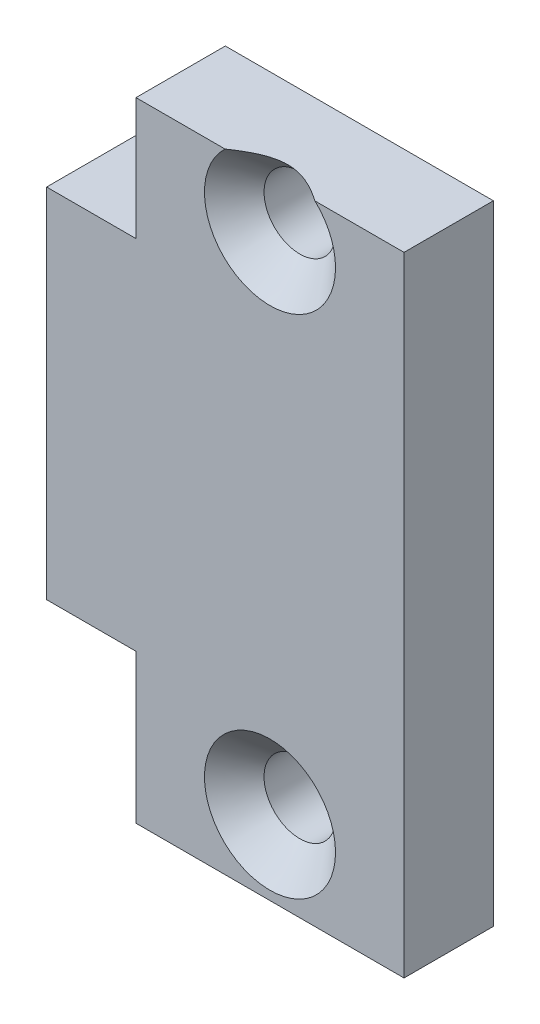
ISO-10303-21;
HEADER;
FILE_DESCRIPTION(('STEP AP214'),'2;1');
FILE_NAME('part.step','',(''),(''),'','','');
FILE_SCHEMA(('AUTOMOTIVE_DESIGN { 1 0 10303 214 1 1 1 1 }'));
ENDSEC;
DATA;
#1=APPLICATION_CONTEXT('core data for automotive mechanical design processes');
#2=APPLICATION_PROTOCOL_DEFINITION('international standard','automotive_design',2000,#1);
#3=PRODUCT_CONTEXT('',#1,'mechanical');
#4=PRODUCT('Part','Part','',(#3));
#5=PRODUCT_RELATED_PRODUCT_CATEGORY('part','',(#4));
#6=PRODUCT_DEFINITION_FORMATION('','',#4);
#7=PRODUCT_DEFINITION_CONTEXT('part definition',#1,'design');
#8=PRODUCT_DEFINITION('design','',#6,#7);
#9=PRODUCT_DEFINITION_SHAPE('','',#8);
#10=(LENGTH_UNIT() NAMED_UNIT(*) SI_UNIT(.MILLI.,.METRE.));
#11=(NAMED_UNIT(*) PLANE_ANGLE_UNIT() SI_UNIT($,.RADIAN.));
#12=(NAMED_UNIT(*) SI_UNIT($,.STERADIAN.) SOLID_ANGLE_UNIT());
#13=UNCERTAINTY_MEASURE_WITH_UNIT(LENGTH_MEASURE(1.E-05),#10,'distance_accuracy_value','');
#14=(GEOMETRIC_REPRESENTATION_CONTEXT(3) GLOBAL_UNCERTAINTY_ASSIGNED_CONTEXT((#13)) GLOBAL_UNIT_ASSIGNED_CONTEXT((#10,
#11,#12)) REPRESENTATION_CONTEXT('',''));
#15=CARTESIAN_POINT('',(0.,0.,0.));
#16=DIRECTION('',(0.,0.,1.));
#17=DIRECTION('',(1.,0.,0.));
#18=AXIS2_PLACEMENT_3D('',#15,#16,#17);
#19=CARTESIAN_POINT('',(-4.5,-11.,3.));
#20=DIRECTION('',(1.,0.,0.));
#21=DIRECTION('',(0.,0.,-1.));
#22=AXIS2_PLACEMENT_3D('',#19,#20,#21);
#23=PLANE('',#22);
#24=DIRECTION('',(0.,0.,1.));
#25=VECTOR('',#24,1.);
#26=CARTESIAN_POINT('',(-4.5,10.1,0.));
#27=LINE('',#26,#25);
#28=CARTESIAN_POINT('',(-4.5,10.1,0.));
#29=VERTEX_POINT('',#28);
#30=CARTESIAN_POINT('',(-4.5,10.1,3.));
#31=VERTEX_POINT('',#30);
#32=EDGE_CURVE('E169',#29,#31,#27,.T.);
#33=ORIENTED_EDGE('',*,*,#32,.F.);
#34=DIRECTION('',(0.,-1.,0.));
#35=VECTOR('',#34,1.);
#36=CARTESIAN_POINT('',(-4.5,-11.,0.));
#37=LINE('',#36,#35);
#38=CARTESIAN_POINT('',(-4.5,6.,0.));
#39=VERTEX_POINT('',#38);
#40=EDGE_CURVE('E224',#29,#39,#37,.T.);
#41=ORIENTED_EDGE('',*,*,#40,.T.);
#42=DIRECTION('',(0.,0.,-1.));
#43=VECTOR('',#42,1.);
#44=CARTESIAN_POINT('',(-4.5,6.,3.));
#45=LINE('',#44,#43);
#46=CARTESIAN_POINT('',(-4.5,6.,3.));
#47=VERTEX_POINT('',#46);
#48=EDGE_CURVE('E191',#47,#39,#45,.T.);
#49=ORIENTED_EDGE('',*,*,#48,.F.);
#50=DIRECTION('',(0.,-1.,0.));
#51=VECTOR('',#50,1.);
#52=CARTESIAN_POINT('',(-4.5,-11.,3.));
#53=LINE('',#52,#51);
#54=EDGE_CURVE('E44',#31,#47,#53,.T.);
#55=ORIENTED_EDGE('',*,*,#54,.F.);
#56=EDGE_LOOP('',(#33,#41,#49,#55));
#57=FACE_BOUND('',#56,.T.);
#58=ADVANCED_FACE('F40',(#57),#23,.F.);
#59=CARTESIAN_POINT('',(4.5,-11.,3.));
#60=DIRECTION('',(-1.,0.,0.));
#61=DIRECTION('',(0.,0.,1.));
#62=AXIS2_PLACEMENT_3D('',#59,#60,#61);
#63=PLANE('',#62);
#64=DIRECTION('',(0.,0.,-1.));
#65=VECTOR('',#64,1.);
#66=CARTESIAN_POINT('',(4.5,10.1,0.));
#67=LINE('',#66,#65);
#68=CARTESIAN_POINT('',(4.5,10.1,3.));
#69=VERTEX_POINT('',#68);
#70=CARTESIAN_POINT('',(4.5,10.1,0.));
#71=VERTEX_POINT('',#70);
#72=EDGE_CURVE('E188',#69,#71,#67,.T.);
#73=ORIENTED_EDGE('',*,*,#72,.F.);
#74=DIRECTION('',(0.,1.,0.));
#75=VECTOR('',#74,1.);
#76=CARTESIAN_POINT('',(4.5,-11.,3.));
#77=LINE('',#76,#75);
#78=CARTESIAN_POINT('',(4.5,-11.,3.));
#79=VERTEX_POINT('',#78);
#80=EDGE_CURVE('E201',#79,#69,#77,.T.);
#81=ORIENTED_EDGE('',*,*,#80,.F.);
#82=DIRECTION('',(0.,0.,-1.));
#83=VECTOR('',#82,1.);
#84=CARTESIAN_POINT('',(4.5,-11.,3.));
#85=LINE('',#84,#83);
#86=CARTESIAN_POINT('',(4.5,-11.,0.));
#87=VERTEX_POINT('',#86);
#88=EDGE_CURVE('E198',#79,#87,#85,.T.);
#89=ORIENTED_EDGE('',*,*,#88,.T.);
#90=DIRECTION('',(0.,1.,0.));
#91=VECTOR('',#90,1.);
#92=CARTESIAN_POINT('',(4.5,-11.,0.));
#93=LINE('',#92,#91);
#94=EDGE_CURVE('E220',#87,#71,#93,.T.);
#95=ORIENTED_EDGE('',*,*,#94,.T.);
#96=EDGE_LOOP('',(#73,#81,#89,#95));
#97=FACE_BOUND('',#96,.T.);
#98=ADVANCED_FACE('F42',(#97),#63,.F.);
#99=CARTESIAN_POINT('',(0.,0.,3.));
#100=DIRECTION('',(0.,0.,-1.));
#101=DIRECTION('',(-1.,0.,0.));
#102=AXIS2_PLACEMENT_3D('',#99,#100,#101);
#103=PLANE('',#102);
#104=CARTESIAN_POINT('',(0.,-8.5,3.));
#105=DIRECTION('',(0.,0.,1.));
#106=DIRECTION('',(1.,0.,0.));
#107=AXIS2_PLACEMENT_3D('',#104,#105,#106);
#108=CIRCLE('',#107,2.2);
#109=CARTESIAN_POINT('',(2.2,-8.5,3.));
#110=VERTEX_POINT('',#109);
#111=EDGE_CURVE('E275',#110,#110,#108,.T.);
#112=ORIENTED_EDGE('',*,*,#111,.F.);
#113=EDGE_LOOP('',(#112));
#114=FACE_BOUND('',#113,.T.);
#115=DIRECTION('',(1.,0.,0.));
#116=VECTOR('',#115,1.);
#117=CARTESIAN_POINT('',(-4.5,10.1,3.));
#118=LINE('',#117,#116);
#119=CARTESIAN_POINT('',(-1.50996688705415,10.1,3.));
#120=VERTEX_POINT('',#119);
#121=EDGE_CURVE('E60',#31,#120,#118,.T.);
#122=ORIENTED_EDGE('',*,*,#121,.F.);
#123=ORIENTED_EDGE('',*,*,#54,.T.);
#124=DIRECTION('',(1.,0.,0.));
#125=VECTOR('',#124,1.);
#126=CARTESIAN_POINT('',(-7.5,6.,3.));
#127=LINE('',#126,#125);
#128=CARTESIAN_POINT('',(-7.5,6.,3.));
#129=VERTEX_POINT('',#128);
#130=EDGE_CURVE('E288',#129,#47,#127,.T.);
#131=ORIENTED_EDGE('',*,*,#130,.F.);
#132=DIRECTION('',(0.,1.,0.));
#133=VECTOR('',#132,1.);
#134=CARTESIAN_POINT('',(-7.5,-6.,3.));
#135=LINE('',#134,#133);
#136=CARTESIAN_POINT('',(-7.5,-6.,3.));
#137=VERTEX_POINT('',#136);
#138=EDGE_CURVE('E310',#137,#129,#135,.T.);
#139=ORIENTED_EDGE('',*,*,#138,.F.);
#140=DIRECTION('',(1.,0.,0.));
#141=VECTOR('',#140,1.);
#142=CARTESIAN_POINT('',(-7.5,-6.,3.));
#143=LINE('',#142,#141);
#144=CARTESIAN_POINT('',(-4.5,-6.,3.));
#145=VERTEX_POINT('',#144);
#146=EDGE_CURVE('E305',#137,#145,#143,.T.);
#147=ORIENTED_EDGE('',*,*,#146,.T.);
#148=CARTESIAN_POINT('',(-4.5,-11.,3.));
#149=VERTEX_POINT('',#148);
#150=EDGE_CURVE('E71',#145,#149,#53,.T.);
#151=ORIENTED_EDGE('',*,*,#150,.T.);
#152=DIRECTION('',(1.,0.,0.));
#153=VECTOR('',#152,1.);
#154=CARTESIAN_POINT('',(-4.5,-11.,3.));
#155=LINE('',#154,#153);
#156=EDGE_CURVE('E194',#149,#79,#155,.T.);
#157=ORIENTED_EDGE('',*,*,#156,.T.);
#158=ORIENTED_EDGE('',*,*,#80,.T.);
#159=CARTESIAN_POINT('',(1.50996688705415,10.1,3.));
#160=VERTEX_POINT('',#159);
#161=EDGE_CURVE('E177',#160,#69,#118,.T.);
#162=ORIENTED_EDGE('',*,*,#161,.F.);
#163=CARTESIAN_POINT('',(0.,8.5,3.));
#164=DIRECTION('',(0.,0.,1.));
#165=DIRECTION('',(1.,0.,0.));
#166=AXIS2_PLACEMENT_3D('',#163,#164,#165);
#167=CIRCLE('',#166,2.2);
#168=EDGE_CURVE('E186',#120,#160,#167,.T.);
#169=ORIENTED_EDGE('',*,*,#168,.F.);
#170=EDGE_LOOP('',(#122,#123,#131,#139,#147,#151,#157,#158,#162,#169));
#171=FACE_BOUND('',#170,.T.);
#172=ADVANCED_FACE('F181',(#114,#171),#103,.F.);
#173=CARTESIAN_POINT('',(0.,0.,0.));
#174=DIRECTION('',(0.,0.,-1.));
#175=DIRECTION('',(-1.,0.,0.));
#176=AXIS2_PLACEMENT_3D('',#173,#174,#175);
#177=PLANE('',#176);
#178=CARTESIAN_POINT('',(0.,-8.5,0.));
#179=DIRECTION('',(0.,0.,-1.));
#180=DIRECTION('',(-1.,0.,0.));
#181=AXIS2_PLACEMENT_3D('',#178,#179,#180);
#182=CIRCLE('',#181,1.19999999999999);
#183=CARTESIAN_POINT('',(-1.19999999999999,-8.5,0.));
#184=VERTEX_POINT('',#183);
#185=EDGE_CURVE('E223',#184,#184,#182,.T.);
#186=ORIENTED_EDGE('',*,*,#185,.F.);
#187=EDGE_LOOP('',(#186));
#188=FACE_BOUND('',#187,.T.);
#189=CARTESIAN_POINT('',(0.,8.5,0.));
#190=DIRECTION('',(0.,0.,-1.));
#191=DIRECTION('',(-1.,0.,0.));
#192=AXIS2_PLACEMENT_3D('',#189,#190,#191);
#193=CIRCLE('',#192,1.19999999999999);
#194=CARTESIAN_POINT('',(-1.19999999999999,8.5,0.));
#195=VERTEX_POINT('',#194);
#196=EDGE_CURVE('E236',#195,#195,#193,.T.);
#197=ORIENTED_EDGE('',*,*,#196,.F.);
#198=EDGE_LOOP('',(#197));
#199=FACE_BOUND('',#198,.T.);
#200=ORIENTED_EDGE('',*,*,#40,.F.);
#201=DIRECTION('',(-1.,0.,0.));
#202=VECTOR('',#201,1.);
#203=CARTESIAN_POINT('',(-4.5,10.1,0.));
#204=LINE('',#203,#202);
#205=EDGE_CURVE('E172',#71,#29,#204,.T.);
#206=ORIENTED_EDGE('',*,*,#205,.F.);
#207=ORIENTED_EDGE('',*,*,#94,.F.);
#208=DIRECTION('',(1.,0.,0.));
#209=VECTOR('',#208,1.);
#210=CARTESIAN_POINT('',(-4.5,-11.,0.));
#211=LINE('',#210,#209);
#212=CARTESIAN_POINT('',(-4.5,-11.,0.));
#213=VERTEX_POINT('',#212);
#214=EDGE_CURVE('E207',#213,#87,#211,.T.);
#215=ORIENTED_EDGE('',*,*,#214,.F.);
#216=CARTESIAN_POINT('',(-4.5,-6.,0.));
#217=VERTEX_POINT('',#216);
#218=EDGE_CURVE('E211',#217,#213,#37,.T.);
#219=ORIENTED_EDGE('',*,*,#218,.F.);
#220=CARTESIAN_POINT('',(-4.5,-3.79868398264452,0.));
#221=VERTEX_POINT('',#220);
#222=EDGE_CURVE('E235',#221,#217,#37,.T.);
#223=ORIENTED_EDGE('',*,*,#222,.F.);
#224=DIRECTION('',(1.,0.,0.));
#225=VECTOR('',#224,1.);
#226=CARTESIAN_POINT('',(-7.5,-3.79868398264452,0.));
#227=LINE('',#226,#225);
#228=CARTESIAN_POINT('',(-7.5,-3.79868398264452,0.));
#229=VERTEX_POINT('',#228);
#230=EDGE_CURVE('E301',#229,#221,#227,.T.);
#231=ORIENTED_EDGE('',*,*,#230,.F.);
#232=DIRECTION('',(0.,-1.,0.));
#233=VECTOR('',#232,1.);
#234=CARTESIAN_POINT('',(-7.5,3.79868398264452,0.));
#235=LINE('',#234,#233);
#236=CARTESIAN_POINT('',(-7.5,3.79868398264452,0.));
#237=VERTEX_POINT('',#236);
#238=EDGE_CURVE('E433',#237,#229,#235,.T.);
#239=ORIENTED_EDGE('',*,*,#238,.F.);
#240=DIRECTION('',(1.,0.,0.));
#241=VECTOR('',#240,1.);
#242=CARTESIAN_POINT('',(-7.5,3.79868398264452,0.));
#243=LINE('',#242,#241);
#244=CARTESIAN_POINT('',(-4.5,3.79868398264452,0.));
#245=VERTEX_POINT('',#244);
#246=EDGE_CURVE('E296',#237,#245,#243,.T.);
#247=ORIENTED_EDGE('',*,*,#246,.T.);
#248=EDGE_CURVE('E228',#39,#245,#37,.T.);
#249=ORIENTED_EDGE('',*,*,#248,.F.);
#250=EDGE_LOOP('',(#200,#206,#207,#215,#219,#223,#231,#239,#247,#249));
#251=FACE_BOUND('',#250,.T.);
#252=ADVANCED_FACE('F263',(#188,#199,#251),#177,.T.);
#253=CARTESIAN_POINT('',(0.,8.5,3.));
#254=DIRECTION('',(0.,0.,1.));
#255=DIRECTION('',(1.,0.,0.));
#256=AXIS2_PLACEMENT_3D('',#253,#254,#255);
#257=CONICAL_SURFACE('',#256,2.2,0.785398163397448);
#258=CARTESIAN_POINT('',(0.,8.5,2.));
#259=DIRECTION('',(0.,0.,1.));
#260=DIRECTION('',(1.,0.,0.));
#261=AXIS2_PLACEMENT_3D('',#258,#259,#260);
#262=CIRCLE('',#261,1.2);
#263=CARTESIAN_POINT('',(1.2,8.5,2.));
#264=VERTEX_POINT('',#263);
#265=EDGE_CURVE('E282',#264,#264,#262,.T.);
#266=ORIENTED_EDGE('',*,*,#265,.F.);
#267=EDGE_LOOP('',(#266));
#268=FACE_BOUND('',#267,.T.);
#269=CARTESIAN_POINT('',(-3.20182887445577,10.1,4.37934465248859));
#270=CARTESIAN_POINT('',(-3.12853614947158,10.1,4.31379182832102));
#271=CARTESIAN_POINT('',(-3.05502807315389,10.1,4.24847761157401));
#272=CARTESIAN_POINT('',(-2.90746755937087,10.1,4.11845331479738));
#273=CARTESIAN_POINT('',(-2.83341507132932,10.1,4.05374329219854));
#274=CARTESIAN_POINT('',(-2.68438079750646,10.1,3.92482012409343));
#275=CARTESIAN_POINT('',(-2.60939653791931,10.1,3.86060983322152));
#276=CARTESIAN_POINT('',(-2.45863490149013,10.1,3.73313212573307));
#277=CARTESIAN_POINT('',(-2.38285755845312,10.1,3.6698646692048));
#278=CARTESIAN_POINT('',(-2.22593570276166,10.1,3.54092571800481));
#279=CARTESIAN_POINT('',(-2.14473294084436,10.1,3.4753249130966));
#280=CARTESIAN_POINT('',(-1.98093123018198,10.1,3.34589188486072));
#281=CARTESIAN_POINT('',(-1.89833235989646,10.1,3.28205956267508));
#282=CARTESIAN_POINT('',(-1.73145912652458,10.1,3.1568851815129));
#283=CARTESIAN_POINT('',(-1.64718753930119,10.1,3.09553943925733));
#284=CARTESIAN_POINT('',(-1.47632445098495,10.1,2.97618586016186));
#285=CARTESIAN_POINT('',(-1.38973368044018,10.1,2.91817698990935));
#286=CARTESIAN_POINT('',(-1.23774091002173,10.1,2.82226523665156));
#287=CARTESIAN_POINT('',(-1.17306282578654,10.1,2.78322119953104));
#288=CARTESIAN_POINT('',(-1.04174600910055,10.1,2.70848513118061));
#289=CARTESIAN_POINT('',(-0.975106591920854,10.1,2.6727942892733));
#290=CARTESIAN_POINT('',(-0.840142732771387,10.1,2.60621778907623));
#291=CARTESIAN_POINT('',(-0.771837313369966,10.1,2.5752940367165));
#292=CARTESIAN_POINT('',(-0.632818277225735,10.1,2.51942445111484));
#293=CARTESIAN_POINT('',(-0.562106525663244,10.1,2.49447410314791));
#294=CARTESIAN_POINT('',(-0.443500381883852,10.1,2.4597274810717));
#295=CARTESIAN_POINT('',(-0.396265683912665,10.1,2.44768228358472));
#296=CARTESIAN_POINT('',(-0.300991488762931,10.1,2.42740054934075));
#297=CARTESIAN_POINT('',(-0.252952325760666,10.1,2.41916246986682));
#298=CARTESIAN_POINT('',(-0.156477459482139,10.1,2.40692381530357));
#299=CARTESIAN_POINT('',(-0.108043398504506,10.1,2.40291047779933));
#300=CARTESIAN_POINT('',(-0.0110081449667254,10.1,2.39930332986374));
#301=CARTESIAN_POINT('',(0.0375930470793092,10.1,2.39970950584962));
#302=CARTESIAN_POINT('',(0.134510347360759,10.1,2.40491521134275));
#303=CARTESIAN_POINT('',(0.182826678178774,10.1,2.40971066618715));
#304=CARTESIAN_POINT('',(0.278872347532461,10.1,2.42342496186675));
#305=CARTESIAN_POINT('',(0.326601549833291,10.1,2.43234474183303));
#306=CARTESIAN_POINT('',(0.421395958927725,10.1,2.4539145631776));
#307=CARTESIAN_POINT('',(0.468457819361122,10.1,2.46657912560897));
#308=CARTESIAN_POINT('',(0.56158563620134,10.1,2.49511531614254));
#309=CARTESIAN_POINT('',(0.607651581962384,10.1,2.51098697850812));
#310=CARTESIAN_POINT('',(0.768171456261142,10.1,2.5716433107159));
#311=CARTESIAN_POINT('',(0.879896111575032,10.1,2.62363882799123));
#312=CARTESIAN_POINT('',(1.09782706764466,10.1,2.73819435026224));
#313=CARTESIAN_POINT('',(1.20401988045189,10.1,2.80077872863963));
#314=CARTESIAN_POINT('',(1.36087087405826,10.1,2.90007856637253));
#315=CARTESIAN_POINT('',(1.41310657544917,10.1,2.93434289538547));
#316=CARTESIAN_POINT('',(1.51664506340802,10.1,3.00425649434365));
#317=CARTESIAN_POINT('',(1.56794782246458,10.1,3.03990580503344));
#318=CARTESIAN_POINT('',(1.66969851033807,10.1,3.1122754051233));
#319=CARTESIAN_POINT('',(1.72014737054832,10.1,3.14899439036753));
#320=CARTESIAN_POINT('',(1.8203638316988,10.1,3.22334461387101));
#321=CARTESIAN_POINT('',(1.87013145799695,10.1,3.26097581802899));
#322=CARTESIAN_POINT('',(2.03705948280169,10.1,3.3891932892268));
#323=CARTESIAN_POINT('',(2.15288693016817,10.1,3.48151457607307));
#324=CARTESIAN_POINT('',(2.38226799461682,10.1,3.66894758420709));
#325=CARTESIAN_POINT('',(2.49582126942867,10.1,3.76405972029487));
#326=CARTESIAN_POINT('',(2.72131042468619,10.1,3.95627222441099));
#327=CARTESIAN_POINT('',(2.83324561129814,10.1,4.05337340458566));
#328=CARTESIAN_POINT('',(3.05587263708969,10.1,4.24899287485125));
#329=CARTESIAN_POINT('',(3.16656443983364,10.1,4.3475112062779));
#330=CARTESIAN_POINT('',(3.49768016283532,10.1,4.64503269865411));
#331=CARTESIAN_POINT('',(3.71668916589072,10.1,4.84560864480682));
#332=CARTESIAN_POINT('',(4.15233950106787,10.1,5.24919047556957));
#333=CARTESIAN_POINT('',(4.36898142222063,10.1,5.45219572804613));
#334=CARTESIAN_POINT('',(4.77514922442491,10.1,5.83568591316177));
#335=CARTESIAN_POINT('',(4.96484665900095,10.1,6.01598932091867));
#336=CARTESIAN_POINT('',(5.34339055790859,10.1,6.37751587984974));
#337=CARTESIAN_POINT('',(5.53223695418509,10.1,6.55873910219867));
#338=CARTESIAN_POINT('',(5.90862260074649,10.1,6.92121322883283));
#339=CARTESIAN_POINT('',(6.0961641122431,10.1,7.10246178683362));
#340=CARTESIAN_POINT('',(6.47073281461346,10.1,7.4654562555927));
#341=CARTESIAN_POINT('',(6.6577600499652,10.1,7.64720212044278));
#342=CARTESIAN_POINT('',(6.84460899400552,10.1,7.82913026489204));
#343=B_SPLINE_CURVE_WITH_KNOTS('',3,(#269,#270,#271,#272,#273,#274,#275,#276,#277,#278,#279,
#280,#281,#282,#283,#284,#285,#286,#287,#288,#289,#290,#291,#292,#293,#294,#295,#296,#297,#298,
#299,#300,#301,#302,#303,#304,#305,#306,#307,#308,#309,#310,#311,#312,#313,#314,#315,#316,#317,
#318,#319,#320,#321,#322,#323,#324,#325,#326,#327,#328,#329,#330,#331,#332,#333,#334,#335,#336,
#337,#338,#339,#340,#341,#342),.UNSPECIFIED.,.F.,.F.,(4,2,2,2,2,2,2,2,2,2,2,2,2,2,2,2,2,2,2,2,2,
2,2,2,2,2,2,2,2,2,2,2,2,2,2,2,4),(0.,0.294994797046253,0.590017354619906,0.886170553001911,
1.18231117891316,1.49546431418164,1.808599908762,2.12125332115891,2.43380937919982,
2.66038414787755,2.88703897785185,3.11177648776328,3.33634360003526,3.48245064896947,
3.6284984405104,3.77410376270957,3.91970863741118,4.06517848088743,4.21068146495663,
4.35675623166072,4.50283255905207,4.87144987525727,5.24092751270396,5.42832035808236,
5.61571872052186,5.80289745184233,5.99006919666065,6.43434883056739,6.87869483499185,
7.32322603686173,7.76777023129846,8.65866387378407,9.54933052953064,10.3344694669517,
11.1196701135134,11.9021047969373,12.684469536217),.UNSPECIFIED.);
#344=EDGE_CURVE('E11',#120,#160,#343,.T.);
#345=ORIENTED_EDGE('',*,*,#344,.F.);
#346=ORIENTED_EDGE('',*,*,#168,.T.);
#347=EDGE_LOOP('',(#345,#346));
#348=FACE_BOUND('',#347,.T.);
#349=ADVANCED_FACE('F357',(#268,#348),#257,.F.);
#350=DIRECTION('',(0.,0.,1.));
#351=VECTOR('',#350,1.);
#352=CARTESIAN_POINT('',(-4.5,-6.,-2.));
#353=LINE('',#352,#351);
#354=EDGE_CURVE('E51',#217,#145,#353,.T.);
#355=ORIENTED_EDGE('',*,*,#354,.F.);
#356=ORIENTED_EDGE('',*,*,#218,.T.);
#357=DIRECTION('',(0.,0.,-1.));
#358=VECTOR('',#357,1.);
#359=CARTESIAN_POINT('',(-4.5,-11.,3.));
#360=LINE('',#359,#358);
#361=EDGE_CURVE('E252',#149,#213,#360,.T.);
#362=ORIENTED_EDGE('',*,*,#361,.F.);
#363=ORIENTED_EDGE('',*,*,#150,.F.);
#364=EDGE_LOOP('',(#355,#356,#362,#363));
#365=FACE_BOUND('',#364,.T.);
#366=ADVANCED_FACE('F251',(#365),#23,.F.);
#367=CARTESIAN_POINT('',(-4.5,-11.,3.));
#368=DIRECTION('',(0.,1.,0.));
#369=DIRECTION('',(0.,0.,1.));
#370=AXIS2_PLACEMENT_3D('',#367,#368,#369);
#371=PLANE('',#370);
#372=ORIENTED_EDGE('',*,*,#214,.T.);
#373=ORIENTED_EDGE('',*,*,#88,.F.);
#374=ORIENTED_EDGE('',*,*,#156,.F.);
#375=ORIENTED_EDGE('',*,*,#361,.T.);
#376=EDGE_LOOP('',(#372,#373,#374,#375));
#377=FACE_BOUND('',#376,.T.);
#378=ADVANCED_FACE('F257',(#377),#371,.F.);
#379=CARTESIAN_POINT('',(0.,-8.5,3.));
#380=DIRECTION('',(0.,0.,1.));
#381=DIRECTION('',(1.,0.,0.));
#382=AXIS2_PLACEMENT_3D('',#379,#380,#381);
#383=CYLINDRICAL_SURFACE('',#382,1.19999999999999);
#384=ORIENTED_EDGE('',*,*,#185,.T.);
#385=EDGE_LOOP('',(#384));
#386=FACE_BOUND('',#385,.T.);
#387=CARTESIAN_POINT('',(0.,-8.5,2.));
#388=DIRECTION('',(0.,0.,1.));
#389=DIRECTION('',(1.,0.,0.));
#390=AXIS2_PLACEMENT_3D('',#387,#388,#389);
#391=CIRCLE('',#390,1.2);
#392=CARTESIAN_POINT('',(1.2,-8.5,2.));
#393=VERTEX_POINT('',#392);
#394=EDGE_CURVE('E270',#393,#393,#391,.T.);
#395=ORIENTED_EDGE('',*,*,#394,.T.);
#396=EDGE_LOOP('',(#395));
#397=FACE_BOUND('',#396,.T.);
#398=ADVANCED_FACE('F409',(#386,#397),#383,.F.);
#399=CARTESIAN_POINT('',(0.,-8.5,3.));
#400=DIRECTION('',(0.,0.,1.));
#401=DIRECTION('',(1.,0.,0.));
#402=AXIS2_PLACEMENT_3D('',#399,#400,#401);
#403=CONICAL_SURFACE('',#402,2.2,0.785398163397448);
#404=ORIENTED_EDGE('',*,*,#394,.F.);
#405=EDGE_LOOP('',(#404));
#406=FACE_BOUND('',#405,.T.);
#407=ORIENTED_EDGE('',*,*,#111,.T.);
#408=EDGE_LOOP('',(#407));
#409=FACE_BOUND('',#408,.T.);
#410=ADVANCED_FACE('F467',(#406,#409),#403,.F.);
#411=CARTESIAN_POINT('',(0.,8.5,3.));
#412=DIRECTION('',(0.,0.,1.));
#413=DIRECTION('',(1.,0.,0.));
#414=AXIS2_PLACEMENT_3D('',#411,#412,#413);
#415=CYLINDRICAL_SURFACE('',#414,1.19999999999999);
#416=ORIENTED_EDGE('',*,*,#196,.T.);
#417=EDGE_LOOP('',(#416));
#418=FACE_BOUND('',#417,.T.);
#419=ORIENTED_EDGE('',*,*,#265,.T.);
#420=EDGE_LOOP('',(#419));
#421=FACE_BOUND('',#420,.T.);
#422=ADVANCED_FACE('F397',(#418,#421),#415,.F.);
#423=CARTESIAN_POINT('',(-4.5,0.,-4.9));
#424=DIRECTION('',(1.,0.,0.));
#425=DIRECTION('',(0.,0.,-1.));
#426=AXIS2_PLACEMENT_3D('',#423,#424,#425);
#427=PLANE('',#426);
#428=CARTESIAN_POINT('',(-4.5,6.,-2.));
#429=VERTEX_POINT('',#428);
#430=EDGE_CURVE('E319',#39,#429,#45,.T.);
#431=ORIENTED_EDGE('',*,*,#430,.F.);
#432=ORIENTED_EDGE('',*,*,#248,.T.);
#433=CARTESIAN_POINT('',(-4.5,0.,-4.9));
#434=DIRECTION('',(1.,0.,0.));
#435=DIRECTION('',(0.,0.,-1.));
#436=AXIS2_PLACEMENT_3D('',#433,#434,#435);
#437=CIRCLE('',#436,6.2);
#438=CARTESIAN_POINT('',(-4.5,5.4799635035281,-2.));
#439=VERTEX_POINT('',#438);
#440=EDGE_CURVE('E318',#439,#245,#437,.T.);
#441=ORIENTED_EDGE('',*,*,#440,.F.);
#442=DIRECTION('',(0.,-1.,0.));
#443=VECTOR('',#442,1.);
#444=CARTESIAN_POINT('',(-4.5,6.,-2.));
#445=LINE('',#444,#443);
#446=EDGE_CURVE('E315',#429,#439,#445,.T.);
#447=ORIENTED_EDGE('',*,*,#446,.F.);
#448=EDGE_LOOP('',(#431,#432,#441,#447));
#449=FACE_BOUND('',#448,.T.);
#450=ADVANCED_FACE('F372',(#449),#427,.T.);
#451=CARTESIAN_POINT('',(-7.5,6.,3.));
#452=DIRECTION('',(0.,-1.,0.));
#453=DIRECTION('',(0.,0.,-1.));
#454=AXIS2_PLACEMENT_3D('',#451,#452,#453);
#455=PLANE('',#454);
#456=ORIENTED_EDGE('',*,*,#48,.T.);
#457=ORIENTED_EDGE('',*,*,#430,.T.);
#458=DIRECTION('',(1.,0.,0.));
#459=VECTOR('',#458,1.);
#460=CARTESIAN_POINT('',(-7.5,6.,-2.));
#461=LINE('',#460,#459);
#462=CARTESIAN_POINT('',(-7.5,6.,-2.));
#463=VERTEX_POINT('',#462);
#464=EDGE_CURVE('E289',#463,#429,#461,.T.);
#465=ORIENTED_EDGE('',*,*,#464,.F.);
#466=DIRECTION('',(0.,0.,-1.));
#467=VECTOR('',#466,1.);
#468=CARTESIAN_POINT('',(-7.5,6.,3.));
#469=LINE('',#468,#467);
#470=EDGE_CURVE('E426',#129,#463,#469,.T.);
#471=ORIENTED_EDGE('',*,*,#470,.F.);
#472=ORIENTED_EDGE('',*,*,#130,.T.);
#473=EDGE_LOOP('',(#456,#457,#465,#471,#472));
#474=FACE_BOUND('',#473,.T.);
#475=ADVANCED_FACE('F390',(#474),#455,.F.);
#476=CARTESIAN_POINT('',(-7.5,6.,-2.));
#477=DIRECTION('',(0.,0.,1.));
#478=DIRECTION('',(0.,-1.,0.));
#479=AXIS2_PLACEMENT_3D('',#476,#477,#478);
#480=PLANE('',#479);
#481=ORIENTED_EDGE('',*,*,#446,.T.);
#482=DIRECTION('',(1.,0.,0.));
#483=VECTOR('',#482,1.);
#484=CARTESIAN_POINT('',(-7.5,5.4799635035281,-2.));
#485=LINE('',#484,#483);
#486=CARTESIAN_POINT('',(-7.5,5.4799635035281,-2.));
#487=VERTEX_POINT('',#486);
#488=EDGE_CURVE('E293',#487,#439,#485,.T.);
#489=ORIENTED_EDGE('',*,*,#488,.F.);
#490=DIRECTION('',(0.,-1.,0.));
#491=VECTOR('',#490,1.);
#492=CARTESIAN_POINT('',(-7.5,6.,-2.));
#493=LINE('',#492,#491);
#494=EDGE_CURVE('E428',#463,#487,#493,.T.);
#495=ORIENTED_EDGE('',*,*,#494,.F.);
#496=ORIENTED_EDGE('',*,*,#464,.T.);
#497=EDGE_LOOP('',(#481,#489,#495,#496));
#498=FACE_BOUND('',#497,.T.);
#499=ADVANCED_FACE('F387',(#498),#480,.F.);
#500=CARTESIAN_POINT('',(-7.5,0.,-4.9));
#501=DIRECTION('',(1.,0.,0.));
#502=DIRECTION('',(0.,0.,-1.));
#503=AXIS2_PLACEMENT_3D('',#500,#501,#502);
#504=CYLINDRICAL_SURFACE('',#503,6.2);
#505=ORIENTED_EDGE('',*,*,#440,.T.);
#506=ORIENTED_EDGE('',*,*,#246,.F.);
#507=CARTESIAN_POINT('',(-7.5,0.,-4.9));
#508=DIRECTION('',(1.,0.,0.));
#509=DIRECTION('',(0.,0.,-1.));
#510=AXIS2_PLACEMENT_3D('',#507,#508,#509);
#511=CIRCLE('',#510,6.2);
#512=EDGE_CURVE('E431',#487,#237,#511,.T.);
#513=ORIENTED_EDGE('',*,*,#512,.F.);
#514=ORIENTED_EDGE('',*,*,#488,.T.);
#515=EDGE_LOOP('',(#505,#506,#513,#514));
#516=FACE_BOUND('',#515,.T.);
#517=ADVANCED_FACE('F383',(#516),#504,.F.);
#518=CARTESIAN_POINT('',(-7.5,0.,-4.9));
#519=DIRECTION('',(1.,0.,0.));
#520=DIRECTION('',(0.,0.,-1.));
#521=AXIS2_PLACEMENT_3D('',#518,#519,#520);
#522=CYLINDRICAL_SURFACE('',#521,6.2);
#523=CARTESIAN_POINT('',(-4.5,0.,-4.9));
#524=DIRECTION('',(1.,0.,0.));
#525=DIRECTION('',(0.,0.,-1.));
#526=AXIS2_PLACEMENT_3D('',#523,#524,#525);
#527=CIRCLE('',#526,6.2);
#528=CARTESIAN_POINT('',(-4.5,-5.4799635035281,-2.));
#529=VERTEX_POINT('',#528);
#530=EDGE_CURVE('E314',#221,#529,#527,.T.);
#531=ORIENTED_EDGE('',*,*,#530,.T.);
#532=DIRECTION('',(1.,0.,0.));
#533=VECTOR('',#532,1.);
#534=CARTESIAN_POINT('',(-7.5,-5.4799635035281,-2.));
#535=LINE('',#534,#533);
#536=CARTESIAN_POINT('',(-7.5,-5.4799635035281,-2.));
#537=VERTEX_POINT('',#536);
#538=EDGE_CURVE('E297',#537,#529,#535,.T.);
#539=ORIENTED_EDGE('',*,*,#538,.F.);
#540=CARTESIAN_POINT('',(-7.5,0.,-4.9));
#541=DIRECTION('',(1.,0.,0.));
#542=DIRECTION('',(0.,0.,-1.));
#543=AXIS2_PLACEMENT_3D('',#540,#541,#542);
#544=CIRCLE('',#543,6.2);
#545=EDGE_CURVE('E435',#229,#537,#544,.T.);
#546=ORIENTED_EDGE('',*,*,#545,.F.);
#547=ORIENTED_EDGE('',*,*,#230,.T.);
#548=EDGE_LOOP('',(#531,#539,#546,#547));
#549=FACE_BOUND('',#548,.T.);
#550=ADVANCED_FACE('F379',(#549),#522,.F.);
#551=CARTESIAN_POINT('',(-7.5,-5.4799635035281,-2.));
#552=DIRECTION('',(0.,0.,1.));
#553=DIRECTION('',(0.,-1.,0.));
#554=AXIS2_PLACEMENT_3D('',#551,#552,#553);
#555=PLANE('',#554);
#556=DIRECTION('',(0.,-1.,0.));
#557=VECTOR('',#556,1.);
#558=CARTESIAN_POINT('',(-4.5,-5.4799635035281,-2.));
#559=LINE('',#558,#557);
#560=CARTESIAN_POINT('',(-4.5,-6.,-2.));
#561=VERTEX_POINT('',#560);
#562=EDGE_CURVE('E311',#529,#561,#559,.T.);
#563=ORIENTED_EDGE('',*,*,#562,.T.);
#564=DIRECTION('',(1.,0.,0.));
#565=VECTOR('',#564,1.);
#566=CARTESIAN_POINT('',(-7.5,-6.,-2.));
#567=LINE('',#566,#565);
#568=CARTESIAN_POINT('',(-7.5,-6.,-2.));
#569=VERTEX_POINT('',#568);
#570=EDGE_CURVE('E302',#569,#561,#567,.T.);
#571=ORIENTED_EDGE('',*,*,#570,.F.);
#572=DIRECTION('',(0.,-1.,0.));
#573=VECTOR('',#572,1.);
#574=CARTESIAN_POINT('',(-7.5,-5.4799635035281,-2.));
#575=LINE('',#574,#573);
#576=EDGE_CURVE('E437',#537,#569,#575,.T.);
#577=ORIENTED_EDGE('',*,*,#576,.F.);
#578=ORIENTED_EDGE('',*,*,#538,.T.);
#579=EDGE_LOOP('',(#563,#571,#577,#578));
#580=FACE_BOUND('',#579,.T.);
#581=ADVANCED_FACE('F375',(#580),#555,.F.);
#582=CARTESIAN_POINT('',(-7.5,-6.,-2.));
#583=DIRECTION('',(0.,1.,0.));
#584=DIRECTION('',(0.,0.,1.));
#585=AXIS2_PLACEMENT_3D('',#582,#583,#584);
#586=PLANE('',#585);
#587=EDGE_CURVE('E306',#561,#217,#353,.T.);
#588=ORIENTED_EDGE('',*,*,#587,.T.);
#589=ORIENTED_EDGE('',*,*,#354,.T.);
#590=ORIENTED_EDGE('',*,*,#146,.F.);
#591=DIRECTION('',(0.,0.,1.));
#592=VECTOR('',#591,1.);
#593=CARTESIAN_POINT('',(-7.5,-6.,-2.));
#594=LINE('',#593,#592);
#595=EDGE_CURVE('E323',#569,#137,#594,.T.);
#596=ORIENTED_EDGE('',*,*,#595,.F.);
#597=ORIENTED_EDGE('',*,*,#570,.T.);
#598=EDGE_LOOP('',(#588,#589,#590,#596,#597));
#599=FACE_BOUND('',#598,.T.);
#600=ADVANCED_FACE('F368',(#599),#586,.F.);
#601=CARTESIAN_POINT('',(-7.5,0.,-4.9));
#602=DIRECTION('',(1.,0.,0.));
#603=DIRECTION('',(0.,0.,-1.));
#604=AXIS2_PLACEMENT_3D('',#601,#602,#603);
#605=PLANE('',#604);
#606=ORIENTED_EDGE('',*,*,#138,.T.);
#607=ORIENTED_EDGE('',*,*,#470,.T.);
#608=ORIENTED_EDGE('',*,*,#494,.T.);
#609=ORIENTED_EDGE('',*,*,#512,.T.);
#610=ORIENTED_EDGE('',*,*,#238,.T.);
#611=ORIENTED_EDGE('',*,*,#545,.T.);
#612=ORIENTED_EDGE('',*,*,#576,.T.);
#613=ORIENTED_EDGE('',*,*,#595,.T.);
#614=EDGE_LOOP('',(#606,#607,#608,#609,#610,#611,#612,#613));
#615=FACE_BOUND('',#614,.T.);
#616=ADVANCED_FACE('F365',(#615),#605,.F.);
#617=ORIENTED_EDGE('',*,*,#530,.F.);
#618=ORIENTED_EDGE('',*,*,#222,.T.);
#619=ORIENTED_EDGE('',*,*,#587,.F.);
#620=ORIENTED_EDGE('',*,*,#562,.F.);
#621=EDGE_LOOP('',(#617,#618,#619,#620));
#622=FACE_BOUND('',#621,.T.);
#623=ADVANCED_FACE('F364',(#622),#427,.T.);
#624=CARTESIAN_POINT('',(0.,10.1,0.));
#625=DIRECTION('',(0.,1.,0.));
#626=DIRECTION('',(0.,0.,1.));
#627=AXIS2_PLACEMENT_3D('',#624,#625,#626);
#628=PLANE('',#627);
#629=ORIENTED_EDGE('',*,*,#344,.T.);
#630=ORIENTED_EDGE('',*,*,#161,.T.);
#631=ORIENTED_EDGE('',*,*,#72,.T.);
#632=ORIENTED_EDGE('',*,*,#205,.T.);
#633=ORIENTED_EDGE('',*,*,#32,.T.);
#634=ORIENTED_EDGE('',*,*,#121,.T.);
#635=EDGE_LOOP('',(#629,#630,#631,#632,#633,#634));
#636=FACE_BOUND('',#635,.T.);
#637=ADVANCED_FACE('F170',(#636),#628,.T.);
#638=CLOSED_SHELL('',(#58,#98,#172,#252,#349,#366,#378,#398,#410,#422,#450,#475,#499,#517,#550,
#581,#600,#616,#623,#637));
#639=MANIFOLD_SOLID_BREP('B2',#638);
#640=ADVANCED_BREP_SHAPE_REPRESENTATION('',(#18,#639),#14);
#641=SHAPE_DEFINITION_REPRESENTATION(#9,#640);
ENDSEC;
END-ISO-10303-21;
